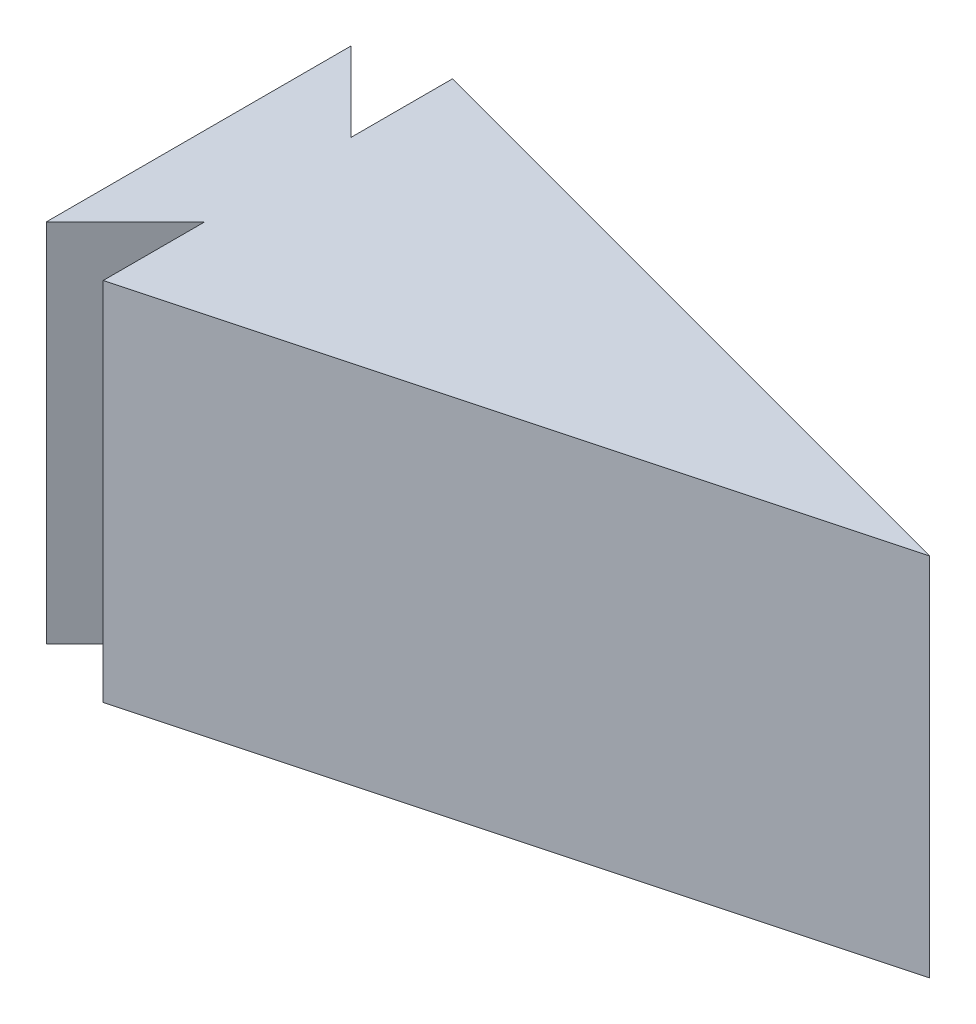
ISO-10303-21;
HEADER;
FILE_DESCRIPTION(('STEP AP214'),'2;1');
FILE_NAME('part.step','',(''),(''),'','','');
FILE_SCHEMA(('AUTOMOTIVE_DESIGN { 1 0 10303 214 1 1 1 1 }'));
ENDSEC;
DATA;
#1=APPLICATION_CONTEXT('core data for automotive mechanical design processes');
#2=APPLICATION_PROTOCOL_DEFINITION('international standard','automotive_design',2000,#1);
#3=PRODUCT_CONTEXT('',#1,'mechanical');
#4=PRODUCT('Part','Part','',(#3));
#5=PRODUCT_RELATED_PRODUCT_CATEGORY('part','',(#4));
#6=PRODUCT_DEFINITION_FORMATION('','',#4);
#7=PRODUCT_DEFINITION_CONTEXT('part definition',#1,'design');
#8=PRODUCT_DEFINITION('design','',#6,#7);
#9=PRODUCT_DEFINITION_SHAPE('','',#8);
#10=(LENGTH_UNIT() NAMED_UNIT(*) SI_UNIT(.MILLI.,.METRE.));
#11=(NAMED_UNIT(*) PLANE_ANGLE_UNIT() SI_UNIT($,.RADIAN.));
#12=(NAMED_UNIT(*) SI_UNIT($,.STERADIAN.) SOLID_ANGLE_UNIT());
#13=UNCERTAINTY_MEASURE_WITH_UNIT(LENGTH_MEASURE(1.E-05),#10,'distance_accuracy_value','');
#14=(GEOMETRIC_REPRESENTATION_CONTEXT(3) GLOBAL_UNCERTAINTY_ASSIGNED_CONTEXT((#13)) GLOBAL_UNIT_ASSIGNED_CONTEXT((#10,
#11,#12)) REPRESENTATION_CONTEXT('',''));
#15=CARTESIAN_POINT('',(0.,0.,0.));
#16=DIRECTION('',(0.,0.,1.));
#17=DIRECTION('',(1.,0.,0.));
#18=AXIS2_PLACEMENT_3D('',#15,#16,#17);
#19=CARTESIAN_POINT('',(8.25499999999992,38.1,-8.255));
#20=DIRECTION('',(-0.707106781186551,0.,-0.707106781186544));
#21=DIRECTION('',(-0.707106781186544,0.,0.707106781186551));
#22=AXIS2_PLACEMENT_3D('',#19,#20,#21);
#23=PLANE('',#22);
#24=DIRECTION('',(0.707106781186544,0.,-0.707106781186551));
#25=VECTOR('',#24,1.);
#26=CARTESIAN_POINT('',(8.25499999999992,0.,-8.255));
#27=LINE('',#26,#25);
#28=CARTESIAN_POINT('',(0.,0.,0.));
#29=VERTEX_POINT('',#28);
#30=CARTESIAN_POINT('',(8.25499999999992,0.,-8.255));
#31=VERTEX_POINT('',#30);
#32=EDGE_CURVE('E123',#29,#31,#27,.T.);
#33=ORIENTED_EDGE('',*,*,#32,.T.);
#34=DIRECTION('',(0.,-1.,0.));
#35=VECTOR('',#34,1.);
#36=CARTESIAN_POINT('',(8.25499999999992,38.1,-8.255));
#37=LINE('',#36,#35);
#38=CARTESIAN_POINT('',(8.25499999999992,38.1,-8.255));
#39=VERTEX_POINT('',#38);
#40=EDGE_CURVE('E11',#39,#31,#37,.T.);
#41=ORIENTED_EDGE('',*,*,#40,.F.);
#42=DIRECTION('',(0.707106781186544,0.,-0.707106781186551));
#43=VECTOR('',#42,1.);
#44=CARTESIAN_POINT('',(8.25499999999992,38.1,-8.255));
#45=LINE('',#44,#43);
#46=CARTESIAN_POINT('',(0.,38.1,0.));
#47=VERTEX_POINT('',#46);
#48=EDGE_CURVE('E135',#47,#39,#45,.T.);
#49=ORIENTED_EDGE('',*,*,#48,.F.);
#50=DIRECTION('',(0.,-1.,0.));
#51=VECTOR('',#50,1.);
#52=CARTESIAN_POINT('',(0.,38.1,0.));
#53=LINE('',#52,#51);
#54=EDGE_CURVE('E119',#47,#29,#53,.T.);
#55=ORIENTED_EDGE('',*,*,#54,.T.);
#56=EDGE_LOOP('',(#33,#41,#49,#55));
#57=FACE_BOUND('',#56,.T.);
#58=ADVANCED_FACE('F33',(#57),#23,.F.);
#59=CARTESIAN_POINT('',(8.25499999999992,38.1,2.33080787973296));
#60=DIRECTION('',(1.,0.,0.));
#61=DIRECTION('',(0.,0.,-1.));
#62=AXIS2_PLACEMENT_3D('',#59,#60,#61);
#63=PLANE('',#62);
#64=DIRECTION('',(0.,0.,1.));
#65=VECTOR('',#64,1.);
#66=CARTESIAN_POINT('',(8.25499999999992,0.,2.33080787973296));
#67=LINE('',#66,#65);
#68=CARTESIAN_POINT('',(8.25499999999992,0.,2.33080787973296));
#69=VERTEX_POINT('',#68);
#70=EDGE_CURVE('E126',#31,#69,#67,.T.);
#71=ORIENTED_EDGE('',*,*,#70,.T.);
#72=DIRECTION('',(0.,-1.,0.));
#73=VECTOR('',#72,1.);
#74=CARTESIAN_POINT('',(8.25499999999992,38.1,2.33080787973296));
#75=LINE('',#74,#73);
#76=CARTESIAN_POINT('',(8.25499999999992,38.1,2.33080787973296));
#77=VERTEX_POINT('',#76);
#78=EDGE_CURVE('E41',#77,#69,#75,.T.);
#79=ORIENTED_EDGE('',*,*,#78,.F.);
#80=DIRECTION('',(0.,0.,1.));
#81=VECTOR('',#80,1.);
#82=CARTESIAN_POINT('',(8.25499999999992,38.1,2.33080787973296));
#83=LINE('',#82,#81);
#84=EDGE_CURVE('E89',#39,#77,#83,.T.);
#85=ORIENTED_EDGE('',*,*,#84,.F.);
#86=ORIENTED_EDGE('',*,*,#40,.T.);
#87=EDGE_LOOP('',(#71,#79,#85,#86));
#88=FACE_BOUND('',#87,.T.);
#89=ADVANCED_FACE('F160',(#88),#63,.F.);
#90=CARTESIAN_POINT('',(76.2,38.1,-15.875));
#91=DIRECTION('',(-0.258819045102525,0.,-0.965925826289067));
#92=DIRECTION('',(-0.965925826289067,0.,0.258819045102525));
#93=AXIS2_PLACEMENT_3D('',#90,#91,#92);
#94=PLANE('',#93);
#95=DIRECTION('',(0.965925826289067,0.,-0.258819045102525));
#96=VECTOR('',#95,1.);
#97=CARTESIAN_POINT('',(76.2,0.,-15.875));
#98=LINE('',#97,#96);
#99=CARTESIAN_POINT('',(76.2,0.,-15.875));
#100=VERTEX_POINT('',#99);
#101=EDGE_CURVE('E128',#69,#100,#98,.T.);
#102=ORIENTED_EDGE('',*,*,#101,.T.);
#103=DIRECTION('',(0.,-1.,0.));
#104=VECTOR('',#103,1.);
#105=CARTESIAN_POINT('',(76.2,38.1,-15.875));
#106=LINE('',#105,#104);
#107=CARTESIAN_POINT('',(76.2,38.1,-15.875));
#108=VERTEX_POINT('',#107);
#109=EDGE_CURVE('E139',#108,#100,#106,.T.);
#110=ORIENTED_EDGE('',*,*,#109,.F.);
#111=DIRECTION('',(0.965925826289067,0.,-0.258819045102525));
#112=VECTOR('',#111,1.);
#113=CARTESIAN_POINT('',(76.2,38.1,-15.875));
#114=LINE('',#113,#112);
#115=EDGE_CURVE('E147',#77,#108,#114,.T.);
#116=ORIENTED_EDGE('',*,*,#115,.F.);
#117=ORIENTED_EDGE('',*,*,#78,.T.);
#118=EDGE_LOOP('',(#102,#110,#116,#117));
#119=FACE_BOUND('',#118,.T.);
#120=ADVANCED_FACE('F145',(#119),#94,.F.);
#121=CARTESIAN_POINT('',(8.25499999999992,38.1,-34.080807879733));
#122=DIRECTION('',(-0.258819045102525,0.,0.965925826289067));
#123=DIRECTION('',(0.965925826289067,0.,0.258819045102525));
#124=AXIS2_PLACEMENT_3D('',#121,#122,#123);
#125=PLANE('',#124);
#126=DIRECTION('',(-0.965925826289067,0.,-0.258819045102525));
#127=VECTOR('',#126,1.);
#128=CARTESIAN_POINT('',(8.25499999999992,0.,-34.080807879733));
#129=LINE('',#128,#127);
#130=CARTESIAN_POINT('',(8.25499999999992,0.,-34.080807879733));
#131=VERTEX_POINT('',#130);
#132=EDGE_CURVE('E130',#100,#131,#129,.T.);
#133=ORIENTED_EDGE('',*,*,#132,.T.);
#134=DIRECTION('',(0.,-1.,0.));
#135=VECTOR('',#134,1.);
#136=CARTESIAN_POINT('',(8.25499999999992,38.1,-34.080807879733));
#137=LINE('',#136,#135);
#138=CARTESIAN_POINT('',(8.25499999999992,38.1,-34.080807879733));
#139=VERTEX_POINT('',#138);
#140=EDGE_CURVE('E114',#139,#131,#137,.T.);
#141=ORIENTED_EDGE('',*,*,#140,.F.);
#142=DIRECTION('',(-0.965925826289067,0.,-0.258819045102525));
#143=VECTOR('',#142,1.);
#144=CARTESIAN_POINT('',(8.25499999999992,38.1,-34.080807879733));
#145=LINE('',#144,#143);
#146=EDGE_CURVE('E105',#108,#139,#145,.T.);
#147=ORIENTED_EDGE('',*,*,#146,.F.);
#148=ORIENTED_EDGE('',*,*,#109,.T.);
#149=EDGE_LOOP('',(#133,#141,#147,#148));
#150=FACE_BOUND('',#149,.T.);
#151=ADVANCED_FACE('F153',(#150),#125,.F.);
#152=CARTESIAN_POINT('',(8.25499999999992,38.1,-23.495));
#153=DIRECTION('',(1.,0.,0.));
#154=DIRECTION('',(0.,0.,-1.));
#155=AXIS2_PLACEMENT_3D('',#152,#153,#154);
#156=PLANE('',#155);
#157=DIRECTION('',(0.,0.,1.));
#158=VECTOR('',#157,1.);
#159=CARTESIAN_POINT('',(8.25499999999992,0.,-23.495));
#160=LINE('',#159,#158);
#161=CARTESIAN_POINT('',(8.25499999999992,0.,-23.495));
#162=VERTEX_POINT('',#161);
#163=EDGE_CURVE('E113',#131,#162,#160,.T.);
#164=ORIENTED_EDGE('',*,*,#163,.T.);
#165=DIRECTION('',(0.,-1.,0.));
#166=VECTOR('',#165,1.);
#167=CARTESIAN_POINT('',(8.25499999999992,38.1,-23.495));
#168=LINE('',#167,#166);
#169=CARTESIAN_POINT('',(8.25499999999992,38.1,-23.495));
#170=VERTEX_POINT('',#169);
#171=EDGE_CURVE('E110',#170,#162,#168,.T.);
#172=ORIENTED_EDGE('',*,*,#171,.F.);
#173=DIRECTION('',(0.,0.,1.));
#174=VECTOR('',#173,1.);
#175=CARTESIAN_POINT('',(8.25499999999992,38.1,-23.495));
#176=LINE('',#175,#174);
#177=EDGE_CURVE('E99',#139,#170,#176,.T.);
#178=ORIENTED_EDGE('',*,*,#177,.F.);
#179=ORIENTED_EDGE('',*,*,#140,.T.);
#180=EDGE_LOOP('',(#164,#172,#178,#179));
#181=FACE_BOUND('',#180,.T.);
#182=ADVANCED_FACE('F111',(#181),#156,.F.);
#183=CARTESIAN_POINT('',(0.,38.1,-31.75));
#184=DIRECTION('',(-0.707106781186551,0.,0.707106781186544));
#185=DIRECTION('',(0.707106781186544,0.,0.707106781186551));
#186=AXIS2_PLACEMENT_3D('',#183,#184,#185);
#187=PLANE('',#186);
#188=DIRECTION('',(-0.707106781186544,0.,-0.707106781186551));
#189=VECTOR('',#188,1.);
#190=CARTESIAN_POINT('',(0.,0.,-31.75));
#191=LINE('',#190,#189);
#192=CARTESIAN_POINT('',(0.,0.,-31.75));
#193=VERTEX_POINT('',#192);
#194=EDGE_CURVE('E75',#162,#193,#191,.T.);
#195=ORIENTED_EDGE('',*,*,#194,.T.);
#196=DIRECTION('',(0.,-1.,0.));
#197=VECTOR('',#196,1.);
#198=CARTESIAN_POINT('',(0.,38.1,-31.75));
#199=LINE('',#198,#197);
#200=CARTESIAN_POINT('',(0.,38.1,-31.75));
#201=VERTEX_POINT('',#200);
#202=EDGE_CURVE('E115',#201,#193,#199,.T.);
#203=ORIENTED_EDGE('',*,*,#202,.F.);
#204=DIRECTION('',(-0.707106781186544,0.,-0.707106781186551));
#205=VECTOR('',#204,1.);
#206=CARTESIAN_POINT('',(0.,38.1,-31.75));
#207=LINE('',#206,#205);
#208=EDGE_CURVE('E103',#170,#201,#207,.T.);
#209=ORIENTED_EDGE('',*,*,#208,.F.);
#210=ORIENTED_EDGE('',*,*,#171,.T.);
#211=EDGE_LOOP('',(#195,#203,#209,#210));
#212=FACE_BOUND('',#211,.T.);
#213=ADVANCED_FACE('F117',(#212),#187,.F.);
#214=CARTESIAN_POINT('',(0.,38.1,0.));
#215=DIRECTION('',(1.,0.,0.));
#216=DIRECTION('',(0.,0.,-1.));
#217=AXIS2_PLACEMENT_3D('',#214,#215,#216);
#218=PLANE('',#217);
#219=DIRECTION('',(0.,0.,1.));
#220=VECTOR('',#219,1.);
#221=CARTESIAN_POINT('',(0.,0.,0.));
#222=LINE('',#221,#220);
#223=EDGE_CURVE('E81',#193,#29,#222,.T.);
#224=ORIENTED_EDGE('',*,*,#223,.T.);
#225=ORIENTED_EDGE('',*,*,#54,.F.);
#226=DIRECTION('',(0.,0.,1.));
#227=VECTOR('',#226,1.);
#228=CARTESIAN_POINT('',(0.,38.1,0.));
#229=LINE('',#228,#227);
#230=EDGE_CURVE('E49',#201,#47,#229,.T.);
#231=ORIENTED_EDGE('',*,*,#230,.F.);
#232=ORIENTED_EDGE('',*,*,#202,.T.);
#233=EDGE_LOOP('',(#224,#225,#231,#232));
#234=FACE_BOUND('',#233,.T.);
#235=ADVANCED_FACE('F174',(#234),#218,.F.);
#236=CARTESIAN_POINT('',(0.,38.1,0.));
#237=DIRECTION('',(0.,1.,0.));
#238=DIRECTION('',(0.,0.,1.));
#239=AXIS2_PLACEMENT_3D('',#236,#237,#238);
#240=PLANE('',#239);
#241=ORIENTED_EDGE('',*,*,#48,.T.);
#242=ORIENTED_EDGE('',*,*,#84,.T.);
#243=ORIENTED_EDGE('',*,*,#115,.T.);
#244=ORIENTED_EDGE('',*,*,#146,.T.);
#245=ORIENTED_EDGE('',*,*,#177,.T.);
#246=ORIENTED_EDGE('',*,*,#208,.T.);
#247=ORIENTED_EDGE('',*,*,#230,.T.);
#248=EDGE_LOOP('',(#241,#242,#243,#244,#245,#246,#247));
#249=FACE_BOUND('',#248,.T.);
#250=ADVANCED_FACE('F101',(#249),#240,.T.);
#251=CARTESIAN_POINT('',(0.,0.,0.));
#252=DIRECTION('',(0.,1.,0.));
#253=DIRECTION('',(0.,0.,1.));
#254=AXIS2_PLACEMENT_3D('',#251,#252,#253);
#255=PLANE('',#254);
#256=ORIENTED_EDGE('',*,*,#32,.F.);
#257=ORIENTED_EDGE('',*,*,#223,.F.);
#258=ORIENTED_EDGE('',*,*,#194,.F.);
#259=ORIENTED_EDGE('',*,*,#163,.F.);
#260=ORIENTED_EDGE('',*,*,#132,.F.);
#261=ORIENTED_EDGE('',*,*,#101,.F.);
#262=ORIENTED_EDGE('',*,*,#70,.F.);
#263=EDGE_LOOP('',(#256,#257,#258,#259,#260,#261,#262));
#264=FACE_BOUND('',#263,.T.);
#265=ADVANCED_FACE('F151',(#264),#255,.F.);
#266=CLOSED_SHELL('',(#58,#89,#120,#151,#182,#213,#235,#250,#265));
#267=MANIFOLD_SOLID_BREP('B2',#266);
#268=ADVANCED_BREP_SHAPE_REPRESENTATION('',(#18,#267),#14);
#269=SHAPE_DEFINITION_REPRESENTATION(#9,#268);
ENDSEC;
END-ISO-10303-21;
